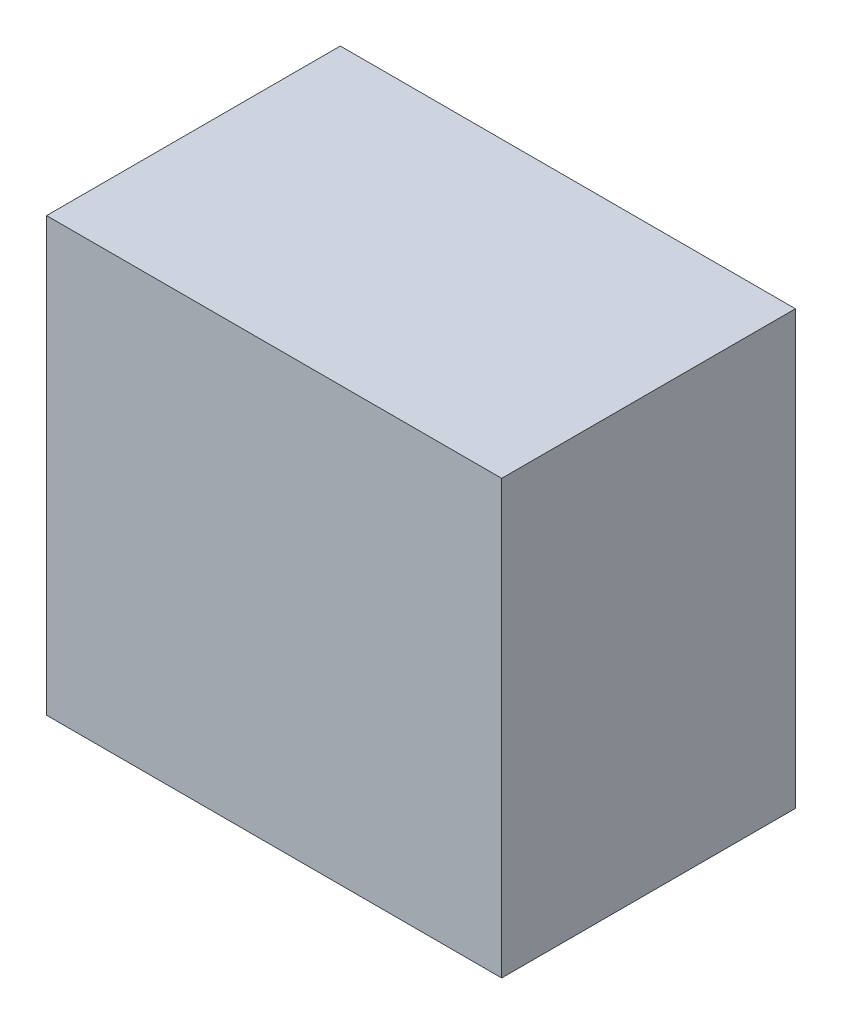
ISO-10303-21;
HEADER;
FILE_DESCRIPTION(('STEP AP214'),'2;1');
FILE_NAME('part.step','',(''),(''),'','','');
FILE_SCHEMA(('AUTOMOTIVE_DESIGN { 1 0 10303 214 1 1 1 1 }'));
ENDSEC;
DATA;
#1=APPLICATION_CONTEXT('core data for automotive mechanical design processes');
#2=APPLICATION_PROTOCOL_DEFINITION('international standard','automotive_design',2000,#1);
#3=PRODUCT_CONTEXT('',#1,'mechanical');
#4=PRODUCT('Part','Part','',(#3));
#5=PRODUCT_RELATED_PRODUCT_CATEGORY('part','',(#4));
#6=PRODUCT_DEFINITION_FORMATION('','',#4);
#7=PRODUCT_DEFINITION_CONTEXT('part definition',#1,'design');
#8=PRODUCT_DEFINITION('design','',#6,#7);
#9=PRODUCT_DEFINITION_SHAPE('','',#8);
#10=(LENGTH_UNIT() NAMED_UNIT(*) SI_UNIT(.MILLI.,.METRE.));
#11=(NAMED_UNIT(*) PLANE_ANGLE_UNIT() SI_UNIT($,.RADIAN.));
#12=(NAMED_UNIT(*) SI_UNIT($,.STERADIAN.) SOLID_ANGLE_UNIT());
#13=UNCERTAINTY_MEASURE_WITH_UNIT(LENGTH_MEASURE(1.E-05),#10,'distance_accuracy_value','');
#14=(GEOMETRIC_REPRESENTATION_CONTEXT(3) GLOBAL_UNCERTAINTY_ASSIGNED_CONTEXT((#13)) GLOBAL_UNIT_ASSIGNED_CONTEXT((#10,
#11,#12)) REPRESENTATION_CONTEXT('',''));
#15=CARTESIAN_POINT('',(0.,0.,0.));
#16=DIRECTION('',(0.,0.,1.));
#17=DIRECTION('',(1.,0.,0.));
#18=AXIS2_PLACEMENT_3D('',#15,#16,#17);
#19=CARTESIAN_POINT('',(0.,0.,1.00000054));
#20=DIRECTION('',(0.,0.,1.));
#21=DIRECTION('',(1.,0.,0.));
#22=AXIS2_PLACEMENT_3D('',#19,#20,#21);
#23=PLANE('',#22);
#24=DIRECTION('',(0.,-1.,0.));
#25=VECTOR('',#24,1.);
#26=CARTESIAN_POINT('',(-0.7747,0.7366,1.00000054));
#27=LINE('',#26,#25);
#28=CARTESIAN_POINT('',(-0.7747,0.7366,1.00000054));
#29=VERTEX_POINT('',#28);
#30=CARTESIAN_POINT('',(-0.7747,-0.7366,1.00000054));
#31=VERTEX_POINT('',#30);
#32=EDGE_CURVE('E82',#29,#31,#27,.T.);
#33=ORIENTED_EDGE('',*,*,#32,.T.);
#34=DIRECTION('',(1.,0.,0.));
#35=VECTOR('',#34,1.);
#36=CARTESIAN_POINT('',(-0.7747,-0.7366,1.00000054));
#37=LINE('',#36,#35);
#38=CARTESIAN_POINT('',(0.7747,-0.7366,1.00000054));
#39=VERTEX_POINT('',#38);
#40=EDGE_CURVE('E107',#31,#39,#37,.T.);
#41=ORIENTED_EDGE('',*,*,#40,.T.);
#42=DIRECTION('',(0.,1.,0.));
#43=VECTOR('',#42,1.);
#44=CARTESIAN_POINT('',(0.7747,-0.7366,1.00000054));
#45=LINE('',#44,#43);
#46=CARTESIAN_POINT('',(0.7747,0.7366,1.00000054));
#47=VERTEX_POINT('',#46);
#48=EDGE_CURVE('E74',#39,#47,#45,.T.);
#49=ORIENTED_EDGE('',*,*,#48,.T.);
#50=DIRECTION('',(-1.,0.,0.));
#51=VECTOR('',#50,1.);
#52=CARTESIAN_POINT('',(0.7747,0.7366,1.00000054));
#53=LINE('',#52,#51);
#54=EDGE_CURVE('E11',#47,#29,#53,.T.);
#55=ORIENTED_EDGE('',*,*,#54,.T.);
#56=EDGE_LOOP('',(#33,#41,#49,#55));
#57=FACE_BOUND('',#56,.T.);
#58=ADVANCED_FACE('F17',(#57),#23,.T.);
#59=CARTESIAN_POINT('',(0.,0.,0.));
#60=DIRECTION('',(0.,0.,1.));
#61=DIRECTION('',(1.,0.,0.));
#62=AXIS2_PLACEMENT_3D('',#59,#60,#61);
#63=PLANE('',#62);
#64=DIRECTION('',(-1.,0.,0.));
#65=VECTOR('',#64,1.);
#66=CARTESIAN_POINT('',(0.7747,0.7366,0.));
#67=LINE('',#66,#65);
#68=CARTESIAN_POINT('',(0.7747,0.7366,0.));
#69=VERTEX_POINT('',#68);
#70=CARTESIAN_POINT('',(-0.7747,0.7366,0.));
#71=VERTEX_POINT('',#70);
#72=EDGE_CURVE('E25',#69,#71,#67,.T.);
#73=ORIENTED_EDGE('',*,*,#72,.F.);
#74=DIRECTION('',(0.,1.,0.));
#75=VECTOR('',#74,1.);
#76=CARTESIAN_POINT('',(0.7747,-0.7366,0.));
#77=LINE('',#76,#75);
#78=CARTESIAN_POINT('',(0.7747,-0.7366,0.));
#79=VERTEX_POINT('',#78);
#80=EDGE_CURVE('E98',#79,#69,#77,.T.);
#81=ORIENTED_EDGE('',*,*,#80,.F.);
#82=DIRECTION('',(1.,0.,0.));
#83=VECTOR('',#82,1.);
#84=CARTESIAN_POINT('',(-0.7747,-0.7366,0.));
#85=LINE('',#84,#83);
#86=CARTESIAN_POINT('',(-0.7747,-0.7366,0.));
#87=VERTEX_POINT('',#86);
#88=EDGE_CURVE('E84',#87,#79,#85,.T.);
#89=ORIENTED_EDGE('',*,*,#88,.F.);
#90=DIRECTION('',(0.,-1.,0.));
#91=VECTOR('',#90,1.);
#92=CARTESIAN_POINT('',(-0.7747,0.7366,0.));
#93=LINE('',#92,#91);
#94=EDGE_CURVE('E80',#71,#87,#93,.T.);
#95=ORIENTED_EDGE('',*,*,#94,.F.);
#96=EDGE_LOOP('',(#73,#81,#89,#95));
#97=FACE_BOUND('',#96,.T.);
#98=ADVANCED_FACE('F86',(#97),#63,.F.);
#99=CARTESIAN_POINT('',(0.7747,0.7366,0.));
#100=DIRECTION('',(0.,-1.,0.));
#101=DIRECTION('',(0.,0.,-1.));
#102=AXIS2_PLACEMENT_3D('',#99,#100,#101);
#103=PLANE('',#102);
#104=ORIENTED_EDGE('',*,*,#72,.T.);
#105=DIRECTION('',(0.,0.,1.));
#106=VECTOR('',#105,1.);
#107=CARTESIAN_POINT('',(-0.7747,0.7366,0.));
#108=LINE('',#107,#106);
#109=EDGE_CURVE('E68',#71,#29,#108,.T.);
#110=ORIENTED_EDGE('',*,*,#109,.T.);
#111=ORIENTED_EDGE('',*,*,#54,.F.);
#112=DIRECTION('',(0.,0.,1.));
#113=VECTOR('',#112,1.);
#114=CARTESIAN_POINT('',(0.7747,0.7366,0.));
#115=LINE('',#114,#113);
#116=EDGE_CURVE('E71',#69,#47,#115,.T.);
#117=ORIENTED_EDGE('',*,*,#116,.F.);
#118=EDGE_LOOP('',(#104,#110,#111,#117));
#119=FACE_BOUND('',#118,.T.);
#120=ADVANCED_FACE('F67',(#119),#103,.F.);
#121=CARTESIAN_POINT('',(0.7747,-0.7366,0.));
#122=DIRECTION('',(-1.,0.,0.));
#123=DIRECTION('',(0.,0.,1.));
#124=AXIS2_PLACEMENT_3D('',#121,#122,#123);
#125=PLANE('',#124);
#126=ORIENTED_EDGE('',*,*,#80,.T.);
#127=ORIENTED_EDGE('',*,*,#116,.T.);
#128=ORIENTED_EDGE('',*,*,#48,.F.);
#129=DIRECTION('',(0.,0.,1.));
#130=VECTOR('',#129,1.);
#131=CARTESIAN_POINT('',(0.7747,-0.7366,0.));
#132=LINE('',#131,#130);
#133=EDGE_CURVE('E100',#79,#39,#132,.T.);
#134=ORIENTED_EDGE('',*,*,#133,.F.);
#135=EDGE_LOOP('',(#126,#127,#128,#134));
#136=FACE_BOUND('',#135,.T.);
#137=ADVANCED_FACE('F117',(#136),#125,.F.);
#138=CARTESIAN_POINT('',(-0.7747,-0.7366,0.));
#139=DIRECTION('',(0.,1.,0.));
#140=DIRECTION('',(1.,0.,0.));
#141=AXIS2_PLACEMENT_3D('',#138,#139,#140);
#142=PLANE('',#141);
#143=ORIENTED_EDGE('',*,*,#88,.T.);
#144=ORIENTED_EDGE('',*,*,#133,.T.);
#145=ORIENTED_EDGE('',*,*,#40,.F.);
#146=DIRECTION('',(0.,0.,1.));
#147=VECTOR('',#146,1.);
#148=CARTESIAN_POINT('',(-0.7747,-0.7366,0.));
#149=LINE('',#148,#147);
#150=EDGE_CURVE('E90',#87,#31,#149,.T.);
#151=ORIENTED_EDGE('',*,*,#150,.F.);
#152=EDGE_LOOP('',(#143,#144,#145,#151));
#153=FACE_BOUND('',#152,.T.);
#154=ADVANCED_FACE('F119',(#153),#142,.F.);
#155=CARTESIAN_POINT('',(-0.7747,0.7366,0.));
#156=DIRECTION('',(1.,0.,0.));
#157=DIRECTION('',(0.,1.,0.));
#158=AXIS2_PLACEMENT_3D('',#155,#156,#157);
#159=PLANE('',#158);
#160=ORIENTED_EDGE('',*,*,#94,.T.);
#161=ORIENTED_EDGE('',*,*,#150,.T.);
#162=ORIENTED_EDGE('',*,*,#32,.F.);
#163=ORIENTED_EDGE('',*,*,#109,.F.);
#164=EDGE_LOOP('',(#160,#161,#162,#163));
#165=FACE_BOUND('',#164,.T.);
#166=ADVANCED_FACE('F78',(#165),#159,.F.);
#167=CLOSED_SHELL('',(#58,#98,#120,#137,#154,#166));
#168=MANIFOLD_SOLID_BREP('B1',#167);
#169=ADVANCED_BREP_SHAPE_REPRESENTATION('',(#18,#168),#14);
#170=SHAPE_DEFINITION_REPRESENTATION(#9,#169);
ENDSEC;
END-ISO-10303-21;
